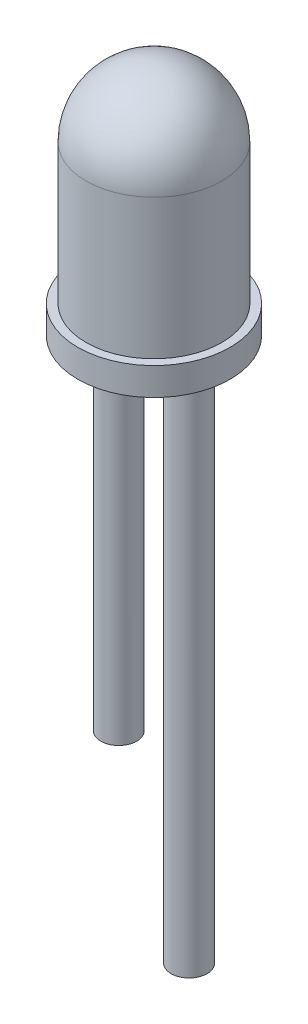
ISO-10303-21;
HEADER;
FILE_DESCRIPTION(('STEP AP214'),'2;1');
FILE_NAME('part.step','',(''),(''),'','','');
FILE_SCHEMA(('AUTOMOTIVE_DESIGN { 1 0 10303 214 1 1 1 1 }'));
ENDSEC;
DATA;
#1=APPLICATION_CONTEXT('core data for automotive mechanical design processes');
#2=APPLICATION_PROTOCOL_DEFINITION('international standard','automotive_design',2000,#1);
#3=PRODUCT_CONTEXT('',#1,'mechanical');
#4=PRODUCT('Part','Part','',(#3));
#5=PRODUCT_RELATED_PRODUCT_CATEGORY('part','',(#4));
#6=PRODUCT_DEFINITION_FORMATION('','',#4);
#7=PRODUCT_DEFINITION_CONTEXT('part definition',#1,'design');
#8=PRODUCT_DEFINITION('design','',#6,#7);
#9=PRODUCT_DEFINITION_SHAPE('','',#8);
#10=(LENGTH_UNIT() NAMED_UNIT(*) SI_UNIT(.MILLI.,.METRE.));
#11=(NAMED_UNIT(*) PLANE_ANGLE_UNIT() SI_UNIT($,.RADIAN.));
#12=(NAMED_UNIT(*) SI_UNIT($,.STERADIAN.) SOLID_ANGLE_UNIT());
#13=UNCERTAINTY_MEASURE_WITH_UNIT(LENGTH_MEASURE(1.E-05),#10,'distance_accuracy_value','');
#14=(GEOMETRIC_REPRESENTATION_CONTEXT(3) GLOBAL_UNCERTAINTY_ASSIGNED_CONTEXT((#13)) GLOBAL_UNIT_ASSIGNED_CONTEXT((#10,
#11,#12)) REPRESENTATION_CONTEXT('',''));
#15=CARTESIAN_POINT('',(0.,0.,0.));
#16=DIRECTION('',(0.,0.,1.));
#17=DIRECTION('',(1.,0.,0.));
#18=AXIS2_PLACEMENT_3D('',#15,#16,#17);
#19=CARTESIAN_POINT('',(0.,1.,0.));
#20=DIRECTION('',(0.,-1.,0.));
#21=DIRECTION('',(0.,0.,-1.));
#22=AXIS2_PLACEMENT_3D('',#19,#20,#21);
#23=CYLINDRICAL_SURFACE('',#22,2.75);
#24=CARTESIAN_POINT('',(0.,1.,0.));
#25=DIRECTION('',(0.,1.,0.));
#26=DIRECTION('',(0.,0.,1.));
#27=AXIS2_PLACEMENT_3D('',#24,#25,#26);
#28=CIRCLE('',#27,2.75);
#29=CARTESIAN_POINT('',(0.,1.,2.75));
#30=VERTEX_POINT('',#29);
#31=EDGE_CURVE('E54',#30,#30,#28,.T.);
#32=ORIENTED_EDGE('',*,*,#31,.F.);
#33=EDGE_LOOP('',(#32));
#34=FACE_BOUND('',#33,.T.);
#35=CARTESIAN_POINT('',(0.,0.,0.));
#36=DIRECTION('',(0.,1.,0.));
#37=DIRECTION('',(0.,0.,1.));
#38=AXIS2_PLACEMENT_3D('',#35,#36,#37);
#39=CIRCLE('',#38,2.75);
#40=CARTESIAN_POINT('',(0.,0.,2.75));
#41=VERTEX_POINT('',#40);
#42=EDGE_CURVE('E57',#41,#41,#39,.T.);
#43=ORIENTED_EDGE('',*,*,#42,.T.);
#44=EDGE_LOOP('',(#43));
#45=FACE_BOUND('',#44,.T.);
#46=ADVANCED_FACE('F34',(#34,#45),#23,.T.);
#47=CARTESIAN_POINT('',(0.,1.,0.));
#48=DIRECTION('',(0.,1.,0.));
#49=DIRECTION('',(0.,0.,1.));
#50=AXIS2_PLACEMENT_3D('',#47,#48,#49);
#51=PLANE('',#50);
#52=CARTESIAN_POINT('',(0.,1.,0.));
#53=DIRECTION('',(0.,1.,0.));
#54=DIRECTION('',(0.,0.,1.));
#55=AXIS2_PLACEMENT_3D('',#52,#53,#54);
#56=CIRCLE('',#55,2.45);
#57=CARTESIAN_POINT('',(0.,1.,2.45));
#58=VERTEX_POINT('',#57);
#59=EDGE_CURVE('E49',#58,#58,#56,.T.);
#60=ORIENTED_EDGE('',*,*,#59,.F.);
#61=EDGE_LOOP('',(#60));
#62=FACE_BOUND('',#61,.T.);
#63=ORIENTED_EDGE('',*,*,#31,.T.);
#64=EDGE_LOOP('',(#63));
#65=FACE_BOUND('',#64,.T.);
#66=ADVANCED_FACE('F84',(#62,#65),#51,.T.);
#67=CARTESIAN_POINT('',(0.,0.,0.));
#68=DIRECTION('',(0.,1.,0.));
#69=DIRECTION('',(0.,0.,1.));
#70=AXIS2_PLACEMENT_3D('',#67,#68,#69);
#71=PLANE('',#70);
#72=CARTESIAN_POINT('',(-1.27,0.,0.));
#73=DIRECTION('',(0.,1.,0.));
#74=DIRECTION('',(0.,0.,1.));
#75=AXIS2_PLACEMENT_3D('',#72,#73,#74);
#76=CIRCLE('',#75,0.65);
#77=CARTESIAN_POINT('',(-1.27,0.,0.65));
#78=VERTEX_POINT('',#77);
#79=EDGE_CURVE('E10',#78,#78,#76,.F.);
#80=ORIENTED_EDGE('',*,*,#79,.F.);
#81=EDGE_LOOP('',(#80));
#82=FACE_BOUND('',#81,.T.);
#83=CARTESIAN_POINT('',(1.27,0.,0.));
#84=DIRECTION('',(0.,1.,0.));
#85=DIRECTION('',(0.,0.,1.));
#86=AXIS2_PLACEMENT_3D('',#83,#84,#85);
#87=CIRCLE('',#86,0.65);
#88=CARTESIAN_POINT('',(1.27,0.,0.65));
#89=VERTEX_POINT('',#88);
#90=EDGE_CURVE('E41',#89,#89,#87,.F.);
#91=ORIENTED_EDGE('',*,*,#90,.F.);
#92=EDGE_LOOP('',(#91));
#93=FACE_BOUND('',#92,.T.);
#94=ORIENTED_EDGE('',*,*,#42,.F.);
#95=EDGE_LOOP('',(#94));
#96=FACE_BOUND('',#95,.T.);
#97=ADVANCED_FACE('F90',(#82,#93,#96),#71,.F.);
#98=CARTESIAN_POINT('',(0.,6.05,0.));
#99=DIRECTION('',(0.,-1.,0.));
#100=DIRECTION('',(0.,0.,-1.));
#101=AXIS2_PLACEMENT_3D('',#98,#99,#100);
#102=CYLINDRICAL_SURFACE('',#101,2.45);
#103=CARTESIAN_POINT('',(0.,6.05,0.));
#104=DIRECTION('',(0.,1.,0.));
#105=DIRECTION('',(0.,0.,1.));
#106=AXIS2_PLACEMENT_3D('',#103,#104,#105);
#107=CIRCLE('',#106,2.45);
#108=CARTESIAN_POINT('',(0.,6.05,2.45));
#109=VERTEX_POINT('',#108);
#110=EDGE_CURVE('E45',#109,#109,#107,.T.);
#111=ORIENTED_EDGE('',*,*,#110,.F.);
#112=EDGE_LOOP('',(#111));
#113=FACE_BOUND('',#112,.T.);
#114=ORIENTED_EDGE('',*,*,#59,.T.);
#115=EDGE_LOOP('',(#114));
#116=FACE_BOUND('',#115,.T.);
#117=ADVANCED_FACE('F36',(#113,#116),#102,.T.);
#118=CARTESIAN_POINT('',(0.,6.05,0.));
#119=DIRECTION('',(0.,0.,1.));
#120=DIRECTION('',(1.,0.,0.));
#121=AXIS2_PLACEMENT_3D('',#118,#119,#120);
#122=SPHERICAL_SURFACE('',#121,2.45);
#123=CARTESIAN_POINT('',(0.,6.05,0.));
#124=DIRECTION('',(0.,1.,0.));
#125=DIRECTION('',(0.,0.,1.));
#126=AXIS2_PLACEMENT_3D('',#123,#124,#125);
#127=SPHERICAL_SURFACE('',#126,2.45);
#128=ORIENTED_EDGE('',*,*,#110,.T.);
#129=EDGE_LOOP('',(#128));
#130=FACE_BOUND('',#129,.T.);
#131=ADVANCED_FACE('F72',(#130),#127,.T.);
#132=CARTESIAN_POINT('',(1.27,-13.,0.));
#133=DIRECTION('',(0.,1.,0.));
#134=DIRECTION('',(0.,0.,1.));
#135=AXIS2_PLACEMENT_3D('',#132,#133,#134);
#136=CYLINDRICAL_SURFACE('',#135,0.65);
#137=ORIENTED_EDGE('',*,*,#90,.T.);
#138=EDGE_LOOP('',(#137));
#139=FACE_BOUND('',#138,.T.);
#140=CARTESIAN_POINT('',(1.27,-19.,0.));
#141=DIRECTION('',(0.,-1.,0.));
#142=DIRECTION('',(0.,0.,-1.));
#143=AXIS2_PLACEMENT_3D('',#140,#141,#142);
#144=CIRCLE('',#143,0.65);
#145=CARTESIAN_POINT('',(1.27,-19.,-0.65));
#146=VERTEX_POINT('',#145);
#147=EDGE_CURVE('E63',#146,#146,#144,.T.);
#148=ORIENTED_EDGE('',*,*,#147,.F.);
#149=EDGE_LOOP('',(#148));
#150=FACE_BOUND('',#149,.T.);
#151=ADVANCED_FACE('F69',(#139,#150),#136,.T.);
#152=CARTESIAN_POINT('',(-1.27,-13.,0.));
#153=DIRECTION('',(0.,1.,0.));
#154=DIRECTION('',(0.,0.,1.));
#155=AXIS2_PLACEMENT_3D('',#152,#153,#154);
#156=CYLINDRICAL_SURFACE('',#155,0.65);
#157=CARTESIAN_POINT('',(-1.27,-13.,0.));
#158=DIRECTION('',(0.,-1.,0.));
#159=DIRECTION('',(0.,0.,-1.));
#160=AXIS2_PLACEMENT_3D('',#157,#158,#159);
#161=CIRCLE('',#160,0.65);
#162=CARTESIAN_POINT('',(-1.27,-13.,-0.65));
#163=VERTEX_POINT('',#162);
#164=EDGE_CURVE('E59',#163,#163,#161,.T.);
#165=ORIENTED_EDGE('',*,*,#164,.F.);
#166=EDGE_LOOP('',(#165));
#167=FACE_BOUND('',#166,.T.);
#168=ORIENTED_EDGE('',*,*,#79,.T.);
#169=EDGE_LOOP('',(#168));
#170=FACE_BOUND('',#169,.T.);
#171=ADVANCED_FACE('F71',(#167,#170),#156,.T.);
#172=CARTESIAN_POINT('',(-1.27,-13.,0.));
#173=DIRECTION('',(0.,-1.,0.));
#174=DIRECTION('',(0.,0.,-1.));
#175=AXIS2_PLACEMENT_3D('',#172,#173,#174);
#176=PLANE('',#175);
#177=ORIENTED_EDGE('',*,*,#164,.T.);
#178=EDGE_LOOP('',(#177));
#179=FACE_BOUND('',#178,.T.);
#180=ADVANCED_FACE('F78',(#179),#176,.T.);
#181=CARTESIAN_POINT('',(1.27,-19.,0.));
#182=DIRECTION('',(0.,-1.,0.));
#183=DIRECTION('',(0.,0.,-1.));
#184=AXIS2_PLACEMENT_3D('',#181,#182,#183);
#185=PLANE('',#184);
#186=ORIENTED_EDGE('',*,*,#147,.T.);
#187=EDGE_LOOP('',(#186));
#188=FACE_BOUND('',#187,.T.);
#189=ADVANCED_FACE('F67',(#188),#185,.T.);
#190=CLOSED_SHELL('',(#46,#66,#97,#117,#131,#151,#171,#180,#189));
#191=MANIFOLD_SOLID_BREP('B2',#190);
#192=ADVANCED_BREP_SHAPE_REPRESENTATION('',(#18,#191),#14);
#193=SHAPE_DEFINITION_REPRESENTATION(#9,#192);
ENDSEC;
END-ISO-10303-21;
